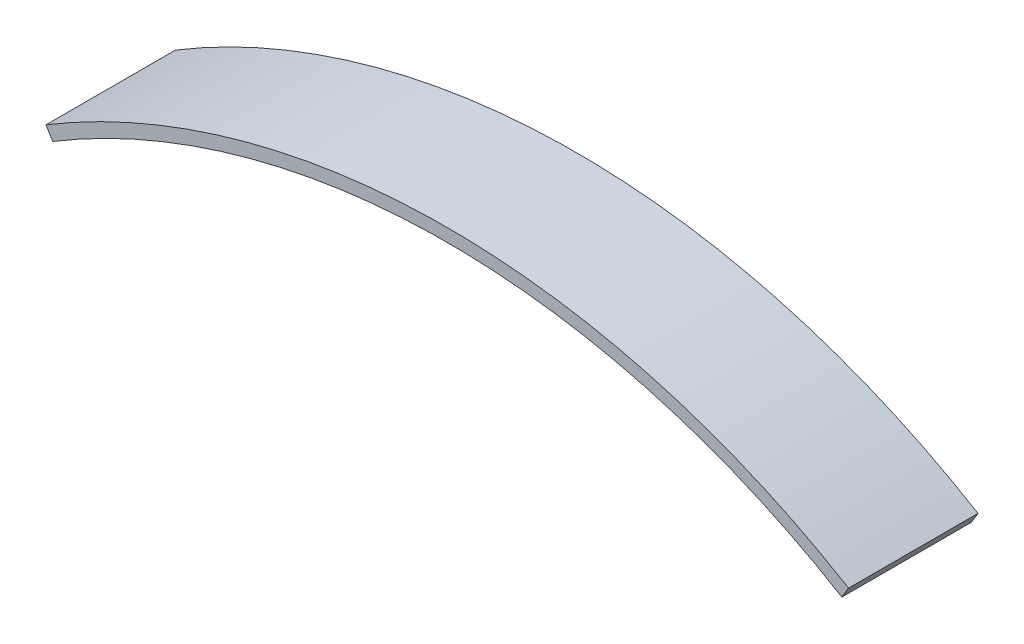
ISO-10303-21;
HEADER;
FILE_DESCRIPTION(('STEP AP214'),'2;1');
FILE_NAME('part.step','',(''),(''),'','','');
FILE_SCHEMA(('AUTOMOTIVE_DESIGN { 1 0 10303 214 1 1 1 1 }'));
ENDSEC;
DATA;
#1=APPLICATION_CONTEXT('core data for automotive mechanical design processes');
#2=APPLICATION_PROTOCOL_DEFINITION('international standard','automotive_design',2000,#1);
#3=PRODUCT_CONTEXT('',#1,'mechanical');
#4=PRODUCT('Part','Part','',(#3));
#5=PRODUCT_RELATED_PRODUCT_CATEGORY('part','',(#4));
#6=PRODUCT_DEFINITION_FORMATION('','',#4);
#7=PRODUCT_DEFINITION_CONTEXT('part definition',#1,'design');
#8=PRODUCT_DEFINITION('design','',#6,#7);
#9=PRODUCT_DEFINITION_SHAPE('','',#8);
#10=(LENGTH_UNIT() NAMED_UNIT(*) SI_UNIT(.MILLI.,.METRE.));
#11=(NAMED_UNIT(*) PLANE_ANGLE_UNIT() SI_UNIT($,.RADIAN.));
#12=(NAMED_UNIT(*) SI_UNIT($,.STERADIAN.) SOLID_ANGLE_UNIT());
#13=UNCERTAINTY_MEASURE_WITH_UNIT(LENGTH_MEASURE(1.E-05),#10,'distance_accuracy_value','');
#14=(GEOMETRIC_REPRESENTATION_CONTEXT(3) GLOBAL_UNCERTAINTY_ASSIGNED_CONTEXT((#13)) GLOBAL_UNIT_ASSIGNED_CONTEXT((#10,
#11,#12)) REPRESENTATION_CONTEXT('',''));
#15=CARTESIAN_POINT('',(0.,0.,0.));
#16=DIRECTION('',(0.,0.,1.));
#17=DIRECTION('',(1.,0.,0.));
#18=AXIS2_PLACEMENT_3D('',#15,#16,#17);
#19=CARTESIAN_POINT('',(31.,-51.3711981561653,10.));
#20=DIRECTION('',(0.,0.,-1.));
#21=DIRECTION('',(-1.,0.,0.));
#22=AXIS2_PLACEMENT_3D('',#19,#20,#21);
#23=CYLINDRICAL_SURFACE('',#22,59.);
#24=CARTESIAN_POINT('',(31.,-51.3711981561653,0.));
#25=DIRECTION('',(0.,0.,1.));
#26=DIRECTION('',(1.,0.,0.));
#27=AXIS2_PLACEMENT_3D('',#24,#25,#26);
#28=CIRCLE('',#27,59.);
#29=CARTESIAN_POINT('',(0.516666666666665,-0.85618663593609,0.));
#30=VERTEX_POINT('',#29);
#31=CARTESIAN_POINT('',(61.4833333333333,-0.85618663593609,0.));
#32=VERTEX_POINT('',#31);
#33=EDGE_CURVE('E111',#30,#32,#28,.F.);
#34=ORIENTED_EDGE('',*,*,#33,.T.);
#35=DIRECTION('',(0.,0.,-1.));
#36=VECTOR('',#35,1.);
#37=CARTESIAN_POINT('',(61.4833333333333,-0.85618663593609,10.));
#38=LINE('',#37,#36);
#39=CARTESIAN_POINT('',(61.4833333333333,-0.85618663593609,10.));
#40=VERTEX_POINT('',#39);
#41=EDGE_CURVE('E11',#40,#32,#38,.T.);
#42=ORIENTED_EDGE('',*,*,#41,.F.);
#43=CARTESIAN_POINT('',(31.,-51.3711981561653,10.));
#44=DIRECTION('',(0.,0.,1.));
#45=DIRECTION('',(1.,0.,0.));
#46=AXIS2_PLACEMENT_3D('',#43,#44,#45);
#47=CIRCLE('',#46,59.);
#48=CARTESIAN_POINT('',(0.516666666666665,-0.85618663593609,10.));
#49=VERTEX_POINT('',#48);
#50=EDGE_CURVE('E84',#49,#40,#47,.F.);
#51=ORIENTED_EDGE('',*,*,#50,.F.);
#52=DIRECTION('',(0.,0.,-1.));
#53=VECTOR('',#52,1.);
#54=CARTESIAN_POINT('',(0.516666666666665,-0.85618663593609,10.));
#55=LINE('',#54,#53);
#56=EDGE_CURVE('E60',#49,#30,#55,.T.);
#57=ORIENTED_EDGE('',*,*,#56,.T.);
#58=EDGE_LOOP('',(#34,#42,#51,#57));
#59=FACE_BOUND('',#58,.T.);
#60=ADVANCED_FACE('F43',(#59),#23,.F.);
#61=CARTESIAN_POINT('',(62.,0.,10.));
#62=DIRECTION('',(0.856186635936089,-0.516666666666665,0.));
#63=DIRECTION('',(0.516666666666665,0.856186635936089,0.));
#64=AXIS2_PLACEMENT_3D('',#61,#62,#63);
#65=PLANE('',#64);
#66=DIRECTION('',(-0.516666666666665,-0.856186635936089,0.));
#67=VECTOR('',#66,1.);
#68=CARTESIAN_POINT('',(62.,0.,0.));
#69=LINE('',#68,#67);
#70=CARTESIAN_POINT('',(62.,0.,0.));
#71=VERTEX_POINT('',#70);
#72=EDGE_CURVE('E93',#71,#32,#69,.T.);
#73=ORIENTED_EDGE('',*,*,#72,.F.);
#74=DIRECTION('',(0.,0.,-1.));
#75=VECTOR('',#74,1.);
#76=CARTESIAN_POINT('',(62.,0.,10.));
#77=LINE('',#76,#75);
#78=CARTESIAN_POINT('',(62.,0.,10.));
#79=VERTEX_POINT('',#78);
#80=EDGE_CURVE('E52',#79,#71,#77,.T.);
#81=ORIENTED_EDGE('',*,*,#80,.F.);
#82=DIRECTION('',(-0.516666666666665,-0.856186635936089,0.));
#83=VECTOR('',#82,1.);
#84=CARTESIAN_POINT('',(62.,0.,10.));
#85=LINE('',#84,#83);
#86=EDGE_CURVE('E91',#79,#40,#85,.T.);
#87=ORIENTED_EDGE('',*,*,#86,.T.);
#88=ORIENTED_EDGE('',*,*,#41,.T.);
#89=EDGE_LOOP('',(#73,#81,#87,#88));
#90=FACE_BOUND('',#89,.T.);
#91=ADVANCED_FACE('F90',(#90),#65,.T.);
#92=CARTESIAN_POINT('',(31.,-51.3711981561653,10.));
#93=DIRECTION('',(0.,0.,-1.));
#94=DIRECTION('',(-1.,0.,0.));
#95=AXIS2_PLACEMENT_3D('',#92,#93,#94);
#96=CYLINDRICAL_SURFACE('',#95,60.);
#97=CARTESIAN_POINT('',(31.,-51.3711981561653,0.));
#98=DIRECTION('',(0.,0.,-1.));
#99=DIRECTION('',(-1.,0.,0.));
#100=AXIS2_PLACEMENT_3D('',#97,#98,#99);
#101=CIRCLE('',#100,60.);
#102=CARTESIAN_POINT('',(0.,0.,0.));
#103=VERTEX_POINT('',#102);
#104=EDGE_CURVE('E116',#103,#71,#101,.T.);
#105=ORIENTED_EDGE('',*,*,#104,.F.);
#106=DIRECTION('',(0.,0.,-1.));
#107=VECTOR('',#106,1.);
#108=CARTESIAN_POINT('',(0.,0.,10.));
#109=LINE('',#108,#107);
#110=CARTESIAN_POINT('',(0.,0.,10.));
#111=VERTEX_POINT('',#110);
#112=EDGE_CURVE('E73',#111,#103,#109,.T.);
#113=ORIENTED_EDGE('',*,*,#112,.F.);
#114=CARTESIAN_POINT('',(31.,-51.3711981561653,10.));
#115=DIRECTION('',(0.,0.,-1.));
#116=DIRECTION('',(-1.,0.,0.));
#117=AXIS2_PLACEMENT_3D('',#114,#115,#116);
#118=CIRCLE('',#117,60.);
#119=EDGE_CURVE('E100',#111,#79,#118,.T.);
#120=ORIENTED_EDGE('',*,*,#119,.T.);
#121=ORIENTED_EDGE('',*,*,#80,.T.);
#122=EDGE_LOOP('',(#105,#113,#120,#121));
#123=FACE_BOUND('',#122,.T.);
#124=ADVANCED_FACE('F103',(#123),#96,.T.);
#125=CARTESIAN_POINT('',(0.516666666666665,-0.85618663593609,10.));
#126=DIRECTION('',(-0.856186635936088,-0.516666666666667,0.));
#127=DIRECTION('',(0.516666666666667,-0.856186635936088,0.));
#128=AXIS2_PLACEMENT_3D('',#125,#126,#127);
#129=PLANE('',#128);
#130=DIRECTION('',(-0.516666666666667,0.856186635936088,0.));
#131=VECTOR('',#130,1.);
#132=CARTESIAN_POINT('',(0.516666666666665,-0.85618663593609,0.));
#133=LINE('',#132,#131);
#134=EDGE_CURVE('E119',#30,#103,#133,.T.);
#135=ORIENTED_EDGE('',*,*,#134,.F.);
#136=ORIENTED_EDGE('',*,*,#56,.F.);
#137=DIRECTION('',(-0.516666666666667,0.856186635936088,0.));
#138=VECTOR('',#137,1.);
#139=CARTESIAN_POINT('',(0.516666666666665,-0.85618663593609,10.));
#140=LINE('',#139,#138);
#141=EDGE_CURVE('E105',#49,#111,#140,.T.);
#142=ORIENTED_EDGE('',*,*,#141,.T.);
#143=ORIENTED_EDGE('',*,*,#112,.T.);
#144=EDGE_LOOP('',(#135,#136,#142,#143));
#145=FACE_BOUND('',#144,.T.);
#146=ADVANCED_FACE('F129',(#145),#129,.T.);
#147=CARTESIAN_POINT('',(31.,-51.3711981561653,10.));
#148=DIRECTION('',(0.,0.,1.));
#149=DIRECTION('',(1.,0.,0.));
#150=AXIS2_PLACEMENT_3D('',#147,#148,#149);
#151=PLANE('',#150);
#152=ORIENTED_EDGE('',*,*,#50,.T.);
#153=ORIENTED_EDGE('',*,*,#86,.F.);
#154=ORIENTED_EDGE('',*,*,#119,.F.);
#155=ORIENTED_EDGE('',*,*,#141,.F.);
#156=EDGE_LOOP('',(#152,#153,#154,#155));
#157=FACE_BOUND('',#156,.T.);
#158=ADVANCED_FACE('F99',(#157),#151,.T.);
#159=CARTESIAN_POINT('',(31.,-51.3711981561653,0.));
#160=DIRECTION('',(0.,0.,1.));
#161=DIRECTION('',(1.,0.,0.));
#162=AXIS2_PLACEMENT_3D('',#159,#160,#161);
#163=PLANE('',#162);
#164=ORIENTED_EDGE('',*,*,#33,.F.);
#165=ORIENTED_EDGE('',*,*,#134,.T.);
#166=ORIENTED_EDGE('',*,*,#104,.T.);
#167=ORIENTED_EDGE('',*,*,#72,.T.);
#168=EDGE_LOOP('',(#164,#165,#166,#167));
#169=FACE_BOUND('',#168,.T.);
#170=ADVANCED_FACE('F128',(#169),#163,.F.);
#171=CLOSED_SHELL('',(#60,#91,#124,#146,#158,#170));
#172=MANIFOLD_SOLID_BREP('B2',#171);
#173=ADVANCED_BREP_SHAPE_REPRESENTATION('',(#18,#172),#14);
#174=SHAPE_DEFINITION_REPRESENTATION(#9,#173);
ENDSEC;
END-ISO-10303-21;
